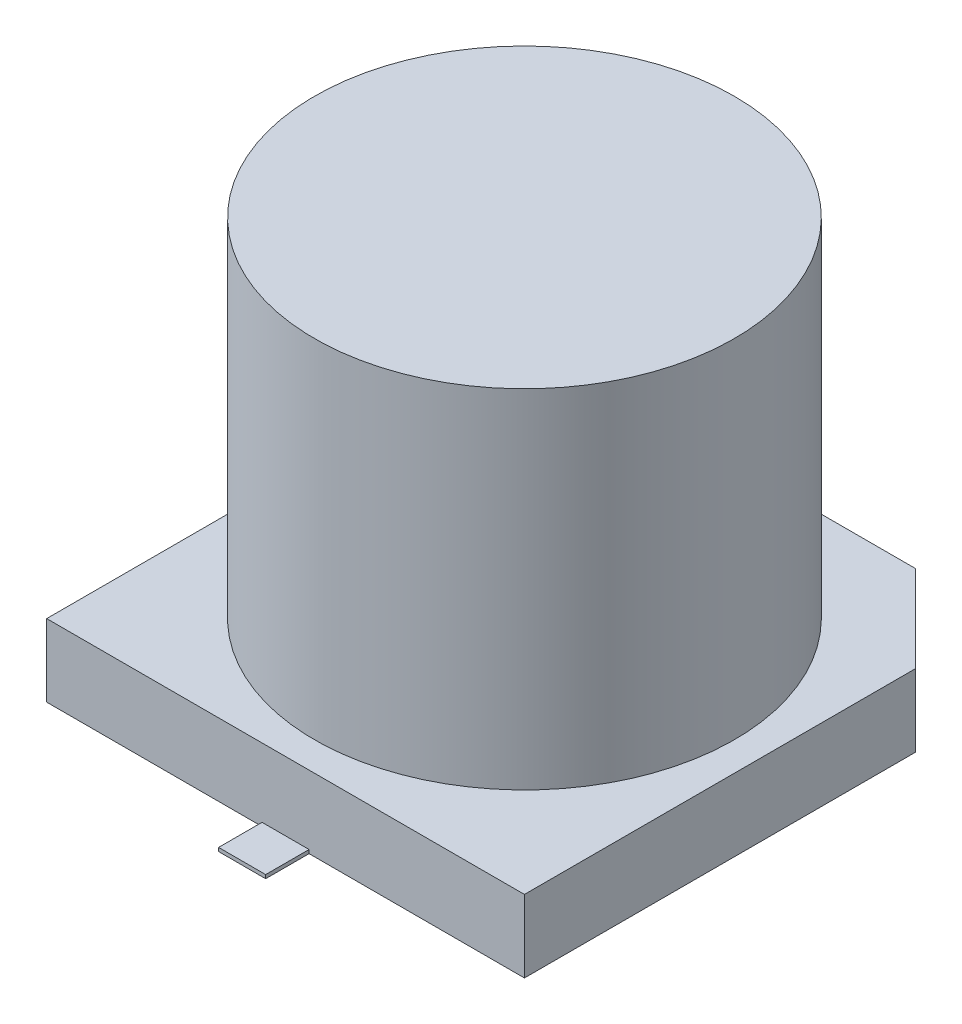
ISO-10303-21;
HEADER;
FILE_DESCRIPTION(('STEP AP214'),'2;1');
FILE_NAME('part.step','',(''),(''),'','','');
FILE_SCHEMA(('AUTOMOTIVE_DESIGN { 1 0 10303 214 1 1 1 1 }'));
ENDSEC;
DATA;
#1=APPLICATION_CONTEXT('core data for automotive mechanical design processes');
#2=APPLICATION_PROTOCOL_DEFINITION('international standard','automotive_design',2000,#1);
#3=PRODUCT_CONTEXT('',#1,'mechanical');
#4=PRODUCT('Part','Part','',(#3));
#5=PRODUCT_RELATED_PRODUCT_CATEGORY('part','',(#4));
#6=PRODUCT_DEFINITION_FORMATION('','',#4);
#7=PRODUCT_DEFINITION_CONTEXT('part definition',#1,'design');
#8=PRODUCT_DEFINITION('design','',#6,#7);
#9=PRODUCT_DEFINITION_SHAPE('','',#8);
#10=(LENGTH_UNIT() NAMED_UNIT(*) SI_UNIT(.MILLI.,.METRE.));
#11=(NAMED_UNIT(*) PLANE_ANGLE_UNIT() SI_UNIT($,.RADIAN.));
#12=(NAMED_UNIT(*) SI_UNIT($,.STERADIAN.) SOLID_ANGLE_UNIT());
#13=UNCERTAINTY_MEASURE_WITH_UNIT(LENGTH_MEASURE(1.E-05),#10,'distance_accuracy_value','');
#14=(GEOMETRIC_REPRESENTATION_CONTEXT(3) GLOBAL_UNCERTAINTY_ASSIGNED_CONTEXT((#13)) GLOBAL_UNIT_ASSIGNED_CONTEXT((#10,
#11,#12)) REPRESENTATION_CONTEXT('',''));
#15=CARTESIAN_POINT('',(0.,0.,0.));
#16=DIRECTION('',(0.,0.,1.));
#17=DIRECTION('',(1.,0.,0.));
#18=AXIS2_PLACEMENT_3D('',#15,#16,#17);
#19=CARTESIAN_POINT('',(0.324999999999992,0.0500000000000014,3.9));
#20=DIRECTION('',(0.,0.,-1.));
#21=DIRECTION('',(-1.,0.,0.));
#22=AXIS2_PLACEMENT_3D('',#19,#20,#21);
#23=PLANE('',#22);
#24=DIRECTION('',(0.,1.,0.));
#25=VECTOR('',#24,1.);
#26=CARTESIAN_POINT('',(0.325000000000006,0.0500000000000014,3.9));
#27=LINE('',#26,#25);
#28=CARTESIAN_POINT('',(0.324999999999995,0.,3.89999999999999));
#29=VERTEX_POINT('',#28);
#30=CARTESIAN_POINT('',(0.324999999999999,0.0500000000000014,3.9));
#31=VERTEX_POINT('',#30);
#32=EDGE_CURVE('E114',#29,#31,#27,.T.);
#33=ORIENTED_EDGE('',*,*,#32,.T.);
#34=DIRECTION('',(1.,0.,0.));
#35=VECTOR('',#34,1.);
#36=CARTESIAN_POINT('',(0.324999999999992,0.0500000000000014,3.9));
#37=LINE('',#36,#35);
#38=CARTESIAN_POINT('',(-0.325000000000006,0.0500000000000014,3.89999999999999));
#39=VERTEX_POINT('',#38);
#40=EDGE_CURVE('E116',#31,#39,#37,.F.);
#41=ORIENTED_EDGE('',*,*,#40,.T.);
#42=DIRECTION('',(0.,1.,0.));
#43=VECTOR('',#42,1.);
#44=CARTESIAN_POINT('',(-0.325000000000006,0.0500000000000014,3.89999999999996));
#45=LINE('',#44,#43);
#46=CARTESIAN_POINT('',(-0.325000000000002,0.,3.89999999999997));
#47=VERTEX_POINT('',#46);
#48=EDGE_CURVE('E119',#39,#47,#45,.F.);
#49=ORIENTED_EDGE('',*,*,#48,.T.);
#50=DIRECTION('',(1.,0.,0.));
#51=VECTOR('',#50,1.);
#52=CARTESIAN_POINT('',(3.3,0.,3.89999999999996));
#53=LINE('',#52,#51);
#54=EDGE_CURVE('E154',#47,#29,#53,.T.);
#55=ORIENTED_EDGE('',*,*,#54,.T.);
#56=EDGE_LOOP('',(#33,#41,#49,#55));
#57=FACE_BOUND('',#56,.T.);
#58=ADVANCED_FACE('F17',(#57),#23,.F.);
#59=CARTESIAN_POINT('',(0.325000000000006,0.0500000000000014,-3.9));
#60=DIRECTION('',(0.,0.,1.));
#61=DIRECTION('',(1.,0.,0.));
#62=AXIS2_PLACEMENT_3D('',#59,#60,#61);
#63=PLANE('',#62);
#64=DIRECTION('',(0.,1.,0.));
#65=VECTOR('',#64,1.);
#66=CARTESIAN_POINT('',(-0.324999999999992,0.0500000000000014,-3.90000000000004));
#67=LINE('',#66,#65);
#68=CARTESIAN_POINT('',(-0.324999999999992,0.,-3.90000000000001));
#69=VERTEX_POINT('',#68);
#70=CARTESIAN_POINT('',(-0.324999999999992,0.0500000000000014,-3.90000000000001));
#71=VERTEX_POINT('',#70);
#72=EDGE_CURVE('E149',#69,#71,#67,.T.);
#73=ORIENTED_EDGE('',*,*,#72,.T.);
#74=DIRECTION('',(1.,0.,0.));
#75=VECTOR('',#74,1.);
#76=CARTESIAN_POINT('',(-0.324999999999992,0.0500000000000014,-3.9));
#77=LINE('',#76,#75);
#78=CARTESIAN_POINT('',(0.324999999999999,0.0500000000000014,-3.9));
#79=VERTEX_POINT('',#78);
#80=EDGE_CURVE('E141',#79,#71,#77,.F.);
#81=ORIENTED_EDGE('',*,*,#80,.F.);
#82=DIRECTION('',(0.,1.,0.));
#83=VECTOR('',#82,1.);
#84=CARTESIAN_POINT('',(0.324999999999992,0.0500000000000014,-3.9));
#85=LINE('',#84,#83);
#86=CARTESIAN_POINT('',(0.324999999999995,0.,-3.9));
#87=VERTEX_POINT('',#86);
#88=EDGE_CURVE('E144',#79,#87,#85,.F.);
#89=ORIENTED_EDGE('',*,*,#88,.T.);
#90=DIRECTION('',(1.,0.,0.));
#91=VECTOR('',#90,1.);
#92=CARTESIAN_POINT('',(3.3,0.,-3.9));
#93=LINE('',#92,#91);
#94=EDGE_CURVE('E161',#87,#69,#93,.F.);
#95=ORIENTED_EDGE('',*,*,#94,.T.);
#96=EDGE_LOOP('',(#73,#81,#89,#95));
#97=FACE_BOUND('',#96,.T.);
#98=ADVANCED_FACE('F294',(#97),#63,.F.);
#99=CARTESIAN_POINT('',(0.324999999999992,0.0500000000000014,3.9));
#100=DIRECTION('',(0.,-1.,0.));
#101=DIRECTION('',(0.,0.,-1.));
#102=AXIS2_PLACEMENT_3D('',#99,#100,#101);
#103=PLANE('',#102);
#104=DIRECTION('',(-1.,0.,0.));
#105=VECTOR('',#104,1.);
#106=CARTESIAN_POINT('',(3.30000000000008,0.0500000000000014,3.29999999999996));
#107=LINE('',#106,#105);
#108=CARTESIAN_POINT('',(0.325000000000006,0.0500000000000014,3.29999999999997));
#109=VERTEX_POINT('',#108);
#110=CARTESIAN_POINT('',(-0.325000000000002,0.0500000000000014,3.29999999999996));
#111=VERTEX_POINT('',#110);
#112=EDGE_CURVE('E128',#109,#111,#107,.T.);
#113=ORIENTED_EDGE('',*,*,#112,.T.);
#114=DIRECTION('',(0.,0.,-1.));
#115=VECTOR('',#114,1.);
#116=CARTESIAN_POINT('',(-0.325000000000006,0.0500000000000014,3.89999999999996));
#117=LINE('',#116,#115);
#118=EDGE_CURVE('E125',#111,#39,#117,.F.);
#119=ORIENTED_EDGE('',*,*,#118,.T.);
#120=ORIENTED_EDGE('',*,*,#40,.F.);
#121=DIRECTION('',(0.,0.,1.));
#122=VECTOR('',#121,1.);
#123=CARTESIAN_POINT('',(0.325000000000006,0.0500000000000014,2.05));
#124=LINE('',#123,#122);
#125=EDGE_CURVE('E139',#31,#109,#124,.F.);
#126=ORIENTED_EDGE('',*,*,#125,.T.);
#127=EDGE_LOOP('',(#113,#119,#120,#126));
#128=FACE_BOUND('',#127,.T.);
#129=ADVANCED_FACE('F126',(#128),#103,.F.);
#130=CARTESIAN_POINT('',(-0.325000000000006,0.0500000000000014,3.89999999999996));
#131=DIRECTION('',(1.,0.,0.));
#132=DIRECTION('',(0.,0.,-1.));
#133=AXIS2_PLACEMENT_3D('',#130,#131,#132);
#134=PLANE('',#133);
#135=DIRECTION('',(0.,1.,0.));
#136=VECTOR('',#135,1.);
#137=CARTESIAN_POINT('',(-0.324999999999992,10.3338095116624,3.29999999999996));
#138=LINE('',#137,#136);
#139=CARTESIAN_POINT('',(-0.324999999999999,0.,3.29999999999997));
#140=VERTEX_POINT('',#139);
#141=EDGE_CURVE('E166',#111,#140,#138,.F.);
#142=ORIENTED_EDGE('',*,*,#141,.T.);
#143=DIRECTION('',(0.,0.,1.));
#144=VECTOR('',#143,1.);
#145=CARTESIAN_POINT('',(-0.324999999999992,0.,-3.30000000000004));
#146=LINE('',#145,#144);
#147=EDGE_CURVE('E134',#140,#47,#146,.T.);
#148=ORIENTED_EDGE('',*,*,#147,.T.);
#149=ORIENTED_EDGE('',*,*,#48,.F.);
#150=ORIENTED_EDGE('',*,*,#118,.F.);
#151=EDGE_LOOP('',(#142,#148,#149,#150));
#152=FACE_BOUND('',#151,.T.);
#153=ADVANCED_FACE('F132',(#152),#134,.F.);
#154=CARTESIAN_POINT('',(0.325000000000006,0.0500000000000014,2.05));
#155=DIRECTION('',(-1.,0.,0.));
#156=DIRECTION('',(0.,0.,1.));
#157=AXIS2_PLACEMENT_3D('',#154,#155,#156);
#158=PLANE('',#157);
#159=DIRECTION('',(0.,1.,0.));
#160=VECTOR('',#159,1.);
#161=CARTESIAN_POINT('',(0.325000000000006,10.3338095116624,3.29999999999996));
#162=LINE('',#161,#160);
#163=CARTESIAN_POINT('',(0.324999999999999,0.,3.29999999999999));
#164=VERTEX_POINT('',#163);
#165=EDGE_CURVE('E173',#164,#109,#162,.T.);
#166=ORIENTED_EDGE('',*,*,#165,.T.);
#167=ORIENTED_EDGE('',*,*,#125,.F.);
#168=ORIENTED_EDGE('',*,*,#32,.F.);
#169=DIRECTION('',(0.,0.,1.));
#170=VECTOR('',#169,1.);
#171=CARTESIAN_POINT('',(0.324999999999992,0.,-3.30000000000004));
#172=LINE('',#171,#170);
#173=EDGE_CURVE('E156',#29,#164,#172,.F.);
#174=ORIENTED_EDGE('',*,*,#173,.T.);
#175=EDGE_LOOP('',(#166,#167,#168,#174));
#176=FACE_BOUND('',#175,.T.);
#177=ADVANCED_FACE('F304',(#176),#158,.F.);
#178=CARTESIAN_POINT('',(-0.324999999999992,0.0500000000000014,-3.90000000000004));
#179=DIRECTION('',(0.,1.,0.));
#180=DIRECTION('',(0.,0.,1.));
#181=AXIS2_PLACEMENT_3D('',#178,#179,#180);
#182=PLANE('',#181);
#183=ORIENTED_EDGE('',*,*,#80,.T.);
#184=DIRECTION('',(0.,0.,-1.));
#185=VECTOR('',#184,1.);
#186=CARTESIAN_POINT('',(-0.324999999999992,0.0500000000000014,-3.90000000000004));
#187=LINE('',#186,#185);
#188=CARTESIAN_POINT('',(-0.324999999999995,0.0500000000000014,-3.30000000000004));
#189=VERTEX_POINT('',#188);
#190=EDGE_CURVE('E151',#71,#189,#187,.F.);
#191=ORIENTED_EDGE('',*,*,#190,.T.);
#192=DIRECTION('',(1.,0.,0.));
#193=VECTOR('',#192,1.);
#194=CARTESIAN_POINT('',(2.1,0.0500000000000014,-3.30000000000004));
#195=LINE('',#194,#193);
#196=CARTESIAN_POINT('',(0.324999999999992,0.0500000000000014,-3.30000000000003));
#197=VERTEX_POINT('',#196);
#198=EDGE_CURVE('E184',#189,#197,#195,.T.);
#199=ORIENTED_EDGE('',*,*,#198,.T.);
#200=DIRECTION('',(0.,0.,1.));
#201=VECTOR('',#200,1.);
#202=CARTESIAN_POINT('',(0.324999999999992,0.0500000000000014,-2.05));
#203=LINE('',#202,#201);
#204=EDGE_CURVE('E146',#197,#79,#203,.F.);
#205=ORIENTED_EDGE('',*,*,#204,.T.);
#206=EDGE_LOOP('',(#183,#191,#199,#205));
#207=FACE_BOUND('',#206,.T.);
#208=ADVANCED_FACE('F288',(#207),#182,.T.);
#209=CARTESIAN_POINT('',(0.324999999999992,0.0500000000000014,-2.05));
#210=DIRECTION('',(-1.,0.,0.));
#211=DIRECTION('',(0.,0.,1.));
#212=AXIS2_PLACEMENT_3D('',#209,#210,#211);
#213=PLANE('',#212);
#214=DIRECTION('',(0.,1.,0.));
#215=VECTOR('',#214,1.);
#216=CARTESIAN_POINT('',(0.324999999999992,10.3338095116624,-3.30000000000004));
#217=LINE('',#216,#215);
#218=CARTESIAN_POINT('',(0.324999999999992,0.,-3.30000000000002));
#219=VERTEX_POINT('',#218);
#220=EDGE_CURVE('E186',#197,#219,#217,.F.);
#221=ORIENTED_EDGE('',*,*,#220,.T.);
#222=DIRECTION('',(0.,0.,1.));
#223=VECTOR('',#222,1.);
#224=CARTESIAN_POINT('',(0.324999999999992,0.,-3.30000000000004));
#225=LINE('',#224,#223);
#226=EDGE_CURVE('E158',#219,#87,#225,.F.);
#227=ORIENTED_EDGE('',*,*,#226,.T.);
#228=ORIENTED_EDGE('',*,*,#88,.F.);
#229=ORIENTED_EDGE('',*,*,#204,.F.);
#230=EDGE_LOOP('',(#221,#227,#228,#229));
#231=FACE_BOUND('',#230,.T.);
#232=ADVANCED_FACE('F285',(#231),#213,.F.);
#233=CARTESIAN_POINT('',(-0.324999999999992,0.0500000000000014,-3.90000000000004));
#234=DIRECTION('',(1.,0.,0.));
#235=DIRECTION('',(0.,0.,-1.));
#236=AXIS2_PLACEMENT_3D('',#233,#234,#235);
#237=PLANE('',#236);
#238=DIRECTION('',(0.,1.,0.));
#239=VECTOR('',#238,1.);
#240=CARTESIAN_POINT('',(-0.325000000000006,10.3338095116624,-3.30000000000004));
#241=LINE('',#240,#239);
#242=CARTESIAN_POINT('',(-0.324999999999995,0.,-3.30000000000004));
#243=VERTEX_POINT('',#242);
#244=EDGE_CURVE('E195',#243,#189,#241,.T.);
#245=ORIENTED_EDGE('',*,*,#244,.T.);
#246=ORIENTED_EDGE('',*,*,#190,.F.);
#247=ORIENTED_EDGE('',*,*,#72,.F.);
#248=DIRECTION('',(0.,0.,1.));
#249=VECTOR('',#248,1.);
#250=CARTESIAN_POINT('',(-0.324999999999992,0.,-3.30000000000004));
#251=LINE('',#250,#249);
#252=EDGE_CURVE('E163',#69,#243,#251,.T.);
#253=ORIENTED_EDGE('',*,*,#252,.T.);
#254=EDGE_LOOP('',(#245,#246,#247,#253));
#255=FACE_BOUND('',#254,.T.);
#256=ADVANCED_FACE('F292',(#255),#237,.F.);
#257=CARTESIAN_POINT('',(3.3,0.,-3.30000000000004));
#258=DIRECTION('',(0.,1.,0.));
#259=DIRECTION('',(0.,0.,1.));
#260=AXIS2_PLACEMENT_3D('',#257,#258,#259);
#261=PLANE('',#260);
#262=ORIENTED_EDGE('',*,*,#252,.F.);
#263=ORIENTED_EDGE('',*,*,#94,.F.);
#264=ORIENTED_EDGE('',*,*,#226,.F.);
#265=DIRECTION('',(1.,0.,0.));
#266=VECTOR('',#265,1.);
#267=CARTESIAN_POINT('',(2.1,0.,-3.30000000000004));
#268=LINE('',#267,#266);
#269=CARTESIAN_POINT('',(2.1,0.,-3.30000000000004));
#270=VERTEX_POINT('',#269);
#271=EDGE_CURVE('E188',#219,#270,#268,.T.);
#272=ORIENTED_EDGE('',*,*,#271,.T.);
#273=DIRECTION('',(0.707106781186546,0.,0.707106781186549));
#274=VECTOR('',#273,1.);
#275=CARTESIAN_POINT('',(2.1,0.,-3.30000000000004));
#276=LINE('',#275,#274);
#277=CARTESIAN_POINT('',(3.30000000000006,0.,-2.1));
#278=VERTEX_POINT('',#277);
#279=EDGE_CURVE('E180',#270,#278,#276,.T.);
#280=ORIENTED_EDGE('',*,*,#279,.T.);
#281=DIRECTION('',(0.,0.,1.));
#282=VECTOR('',#281,1.);
#283=CARTESIAN_POINT('',(3.30000000000008,0.,3.29999999999996));
#284=LINE('',#283,#282);
#285=CARTESIAN_POINT('',(3.30000000000008,0.,3.29999999999998));
#286=VERTEX_POINT('',#285);
#287=EDGE_CURVE('E176',#278,#286,#284,.T.);
#288=ORIENTED_EDGE('',*,*,#287,.T.);
#289=DIRECTION('',(-1.,0.,0.));
#290=VECTOR('',#289,1.);
#291=CARTESIAN_POINT('',(3.30000000000008,0.,3.29999999999996));
#292=LINE('',#291,#290);
#293=EDGE_CURVE('E170',#286,#164,#292,.T.);
#294=ORIENTED_EDGE('',*,*,#293,.T.);
#295=ORIENTED_EDGE('',*,*,#173,.F.);
#296=ORIENTED_EDGE('',*,*,#54,.F.);
#297=ORIENTED_EDGE('',*,*,#147,.F.);
#298=DIRECTION('',(-1.,0.,0.));
#299=VECTOR('',#298,1.);
#300=CARTESIAN_POINT('',(3.30000000000008,0.,3.29999999999996));
#301=LINE('',#300,#299);
#302=CARTESIAN_POINT('',(-3.3,0.,3.29999999999998));
#303=VERTEX_POINT('',#302);
#304=EDGE_CURVE('E168',#140,#303,#301,.T.);
#305=ORIENTED_EDGE('',*,*,#304,.T.);
#306=DIRECTION('',(0.,0.,-1.));
#307=VECTOR('',#306,1.);
#308=CARTESIAN_POINT('',(-3.3,0.,3.3));
#309=LINE('',#308,#307);
#310=CARTESIAN_POINT('',(-3.30000000000001,0.,-2.1));
#311=VERTEX_POINT('',#310);
#312=EDGE_CURVE('E205',#303,#311,#309,.T.);
#313=ORIENTED_EDGE('',*,*,#312,.T.);
#314=DIRECTION('',(0.707106781186549,0.,-0.707106781186546));
#315=VECTOR('',#314,1.);
#316=CARTESIAN_POINT('',(-3.30000000000001,0.,-2.1));
#317=LINE('',#316,#315);
#318=CARTESIAN_POINT('',(-2.10000000000001,0.,-3.30000000000003));
#319=VERTEX_POINT('',#318);
#320=EDGE_CURVE('E198',#311,#319,#317,.T.);
#321=ORIENTED_EDGE('',*,*,#320,.T.);
#322=DIRECTION('',(1.,0.,0.));
#323=VECTOR('',#322,1.);
#324=CARTESIAN_POINT('',(2.1,0.,-3.30000000000004));
#325=LINE('',#324,#323);
#326=EDGE_CURVE('E192',#319,#243,#325,.T.);
#327=ORIENTED_EDGE('',*,*,#326,.T.);
#328=EDGE_LOOP('',(#262,#263,#264,#272,#280,#288,#294,#295,#296,#297,#305,#313,#321,#327));
#329=FACE_BOUND('',#328,.T.);
#330=ADVANCED_FACE('F262',(#329),#261,.F.);
#331=CARTESIAN_POINT('',(3.30000000000008,10.3338095116624,3.29999999999996));
#332=DIRECTION('',(0.,0.,-1.));
#333=DIRECTION('',(-1.,0.,0.));
#334=AXIS2_PLACEMENT_3D('',#331,#332,#333);
#335=PLANE('',#334);
#336=ORIENTED_EDGE('',*,*,#293,.F.);
#337=DIRECTION('',(0.,1.,0.));
#338=VECTOR('',#337,1.);
#339=CARTESIAN_POINT('',(3.30000000000008,10.3338095116624,3.29999999999996));
#340=LINE('',#339,#338);
#341=CARTESIAN_POINT('',(3.30000000000008,1.,3.29999999999997));
#342=VERTEX_POINT('',#341);
#343=EDGE_CURVE('E178',#286,#342,#340,.T.);
#344=ORIENTED_EDGE('',*,*,#343,.T.);
#345=DIRECTION('',(1.,0.,0.));
#346=VECTOR('',#345,1.);
#347=CARTESIAN_POINT('',(0.,1.,3.3));
#348=LINE('',#347,#346);
#349=CARTESIAN_POINT('',(-3.3,1.,3.29999999999998));
#350=VERTEX_POINT('',#349);
#351=EDGE_CURVE('E208',#350,#342,#348,.T.);
#352=ORIENTED_EDGE('',*,*,#351,.F.);
#353=DIRECTION('',(0.,1.,0.));
#354=VECTOR('',#353,1.);
#355=CARTESIAN_POINT('',(-3.3,10.3338095116624,3.3));
#356=LINE('',#355,#354);
#357=EDGE_CURVE('E202',#350,#303,#356,.F.);
#358=ORIENTED_EDGE('',*,*,#357,.T.);
#359=ORIENTED_EDGE('',*,*,#304,.F.);
#360=ORIENTED_EDGE('',*,*,#141,.F.);
#361=ORIENTED_EDGE('',*,*,#112,.F.);
#362=ORIENTED_EDGE('',*,*,#165,.F.);
#363=EDGE_LOOP('',(#336,#344,#352,#358,#359,#360,#361,#362));
#364=FACE_BOUND('',#363,.T.);
#365=ADVANCED_FACE('F269',(#364),#335,.F.);
#366=CARTESIAN_POINT('',(3.30000000000008,10.3338095116624,3.29999999999996));
#367=DIRECTION('',(-1.,0.,0.));
#368=DIRECTION('',(0.,0.,1.));
#369=AXIS2_PLACEMENT_3D('',#366,#367,#368);
#370=PLANE('',#369);
#371=ORIENTED_EDGE('',*,*,#343,.F.);
#372=ORIENTED_EDGE('',*,*,#287,.F.);
#373=DIRECTION('',(0.,1.,0.));
#374=VECTOR('',#373,1.);
#375=CARTESIAN_POINT('',(3.3,10.3338095116624,-2.10000000000004));
#376=LINE('',#375,#374);
#377=CARTESIAN_POINT('',(3.30000000000006,1.,-2.10000000000002));
#378=VERTEX_POINT('',#377);
#379=EDGE_CURVE('E182',#278,#378,#376,.T.);
#380=ORIENTED_EDGE('',*,*,#379,.T.);
#381=DIRECTION('',(0.,0.,1.));
#382=VECTOR('',#381,1.);
#383=CARTESIAN_POINT('',(3.30000000000008,1.,0.));
#384=LINE('',#383,#382);
#385=EDGE_CURVE('E211',#342,#378,#384,.F.);
#386=ORIENTED_EDGE('',*,*,#385,.F.);
#387=EDGE_LOOP('',(#371,#372,#380,#386));
#388=FACE_BOUND('',#387,.T.);
#389=ADVANCED_FACE('F274',(#388),#370,.F.);
#390=CARTESIAN_POINT('',(2.1,10.3338095116624,-3.30000000000004));
#391=DIRECTION('',(-0.707106781186549,0.,0.707106781186546));
#392=DIRECTION('',(0.707106781186546,0.,0.707106781186549));
#393=AXIS2_PLACEMENT_3D('',#390,#391,#392);
#394=PLANE('',#393);
#395=ORIENTED_EDGE('',*,*,#379,.F.);
#396=ORIENTED_EDGE('',*,*,#279,.F.);
#397=DIRECTION('',(0.,1.,0.));
#398=VECTOR('',#397,1.);
#399=CARTESIAN_POINT('',(2.1,10.3338095116624,-3.30000000000004));
#400=LINE('',#399,#398);
#401=CARTESIAN_POINT('',(2.1,0.999999999999999,-3.30000000000004));
#402=VERTEX_POINT('',#401);
#403=EDGE_CURVE('E190',#270,#402,#400,.T.);
#404=ORIENTED_EDGE('',*,*,#403,.T.);
#405=DIRECTION('',(-0.707106781186545,0.,-0.70710678118655));
#406=VECTOR('',#405,1.);
#407=CARTESIAN_POINT('',(3.3,1.,-2.10000000000004));
#408=LINE('',#407,#406);
#409=EDGE_CURVE('E214',#378,#402,#408,.T.);
#410=ORIENTED_EDGE('',*,*,#409,.F.);
#411=EDGE_LOOP('',(#395,#396,#404,#410));
#412=FACE_BOUND('',#411,.T.);
#413=ADVANCED_FACE('F279',(#412),#394,.F.);
#414=CARTESIAN_POINT('',(2.1,10.3338095116624,-3.30000000000004));
#415=DIRECTION('',(0.,0.,1.));
#416=DIRECTION('',(1.,0.,0.));
#417=AXIS2_PLACEMENT_3D('',#414,#415,#416);
#418=PLANE('',#417);
#419=ORIENTED_EDGE('',*,*,#326,.F.);
#420=DIRECTION('',(0.,1.,0.));
#421=VECTOR('',#420,1.);
#422=CARTESIAN_POINT('',(-2.09999999999999,10.3338095116624,-3.30000000000001));
#423=LINE('',#422,#421);
#424=CARTESIAN_POINT('',(-2.10000000000001,1.,-3.30000000000003));
#425=VERTEX_POINT('',#424);
#426=EDGE_CURVE('E200',#319,#425,#423,.T.);
#427=ORIENTED_EDGE('',*,*,#426,.T.);
#428=DIRECTION('',(1.,0.,0.));
#429=VECTOR('',#428,1.);
#430=CARTESIAN_POINT('',(0.,1.,-3.30000000000004));
#431=LINE('',#430,#429);
#432=EDGE_CURVE('E217',#402,#425,#431,.F.);
#433=ORIENTED_EDGE('',*,*,#432,.F.);
#434=ORIENTED_EDGE('',*,*,#403,.F.);
#435=ORIENTED_EDGE('',*,*,#271,.F.);
#436=ORIENTED_EDGE('',*,*,#220,.F.);
#437=ORIENTED_EDGE('',*,*,#198,.F.);
#438=ORIENTED_EDGE('',*,*,#244,.F.);
#439=EDGE_LOOP('',(#419,#427,#433,#434,#435,#436,#437,#438));
#440=FACE_BOUND('',#439,.T.);
#441=ADVANCED_FACE('F256',(#440),#418,.F.);
#442=CARTESIAN_POINT('',(-3.30000000000001,10.3338095116624,-2.1));
#443=DIRECTION('',(0.707106781186546,0.,0.707106781186549));
#444=DIRECTION('',(0.707106781186549,0.,-0.707106781186546));
#445=AXIS2_PLACEMENT_3D('',#442,#443,#444);
#446=PLANE('',#445);
#447=ORIENTED_EDGE('',*,*,#426,.F.);
#448=ORIENTED_EDGE('',*,*,#320,.F.);
#449=DIRECTION('',(0.,1.,0.));
#450=VECTOR('',#449,1.);
#451=CARTESIAN_POINT('',(-3.3,10.3338095116624,-2.1));
#452=LINE('',#451,#450);
#453=CARTESIAN_POINT('',(-3.30000000000001,0.999999999999999,-2.1));
#454=VERTEX_POINT('',#453);
#455=EDGE_CURVE('E33',#311,#454,#452,.T.);
#456=ORIENTED_EDGE('',*,*,#455,.T.);
#457=DIRECTION('',(-0.707106781186533,0.,0.707106781186562));
#458=VECTOR('',#457,1.);
#459=CARTESIAN_POINT('',(-2.10000000000002,1.,-3.30000000000004));
#460=LINE('',#459,#458);
#461=EDGE_CURVE('E220',#425,#454,#460,.T.);
#462=ORIENTED_EDGE('',*,*,#461,.F.);
#463=EDGE_LOOP('',(#447,#448,#456,#462));
#464=FACE_BOUND('',#463,.T.);
#465=ADVANCED_FACE('F243',(#464),#446,.F.);
#466=CARTESIAN_POINT('',(-3.3,10.3338095116624,3.3));
#467=DIRECTION('',(1.,0.,0.));
#468=DIRECTION('',(0.,0.,-1.));
#469=AXIS2_PLACEMENT_3D('',#466,#467,#468);
#470=PLANE('',#469);
#471=ORIENTED_EDGE('',*,*,#455,.F.);
#472=ORIENTED_EDGE('',*,*,#312,.F.);
#473=ORIENTED_EDGE('',*,*,#357,.F.);
#474=DIRECTION('',(0.,0.,1.));
#475=VECTOR('',#474,1.);
#476=CARTESIAN_POINT('',(-3.30000000000001,1.,0.));
#477=LINE('',#476,#475);
#478=EDGE_CURVE('E223',#454,#350,#477,.T.);
#479=ORIENTED_EDGE('',*,*,#478,.F.);
#480=EDGE_LOOP('',(#471,#472,#473,#479));
#481=FACE_BOUND('',#480,.T.);
#482=ADVANCED_FACE('F234',(#481),#470,.F.);
#483=CARTESIAN_POINT('',(0.,5.8,0.));
#484=DIRECTION('',(0.,1.,0.));
#485=DIRECTION('',(0.,0.,1.));
#486=AXIS2_PLACEMENT_3D('',#483,#484,#485);
#487=PLANE('',#486);
#488=CARTESIAN_POINT('',(0.,5.8,0.));
#489=DIRECTION('',(0.,-1.,0.));
#490=DIRECTION('',(0.,0.,-1.));
#491=AXIS2_PLACEMENT_3D('',#488,#489,#490);
#492=CIRCLE('',#491,2.90000000000001);
#493=CARTESIAN_POINT('',(0.,5.8,-2.90000000000001));
#494=VERTEX_POINT('',#493);
#495=EDGE_CURVE('E20',#494,#494,#492,.T.);
#496=ORIENTED_EDGE('',*,*,#495,.F.);
#497=EDGE_LOOP('',(#496));
#498=FACE_BOUND('',#497,.T.);
#499=ADVANCED_FACE('F231',(#498),#487,.T.);
#500=CARTESIAN_POINT('',(0.,1.,0.));
#501=DIRECTION('',(0.,1.,0.));
#502=DIRECTION('',(0.,0.,1.));
#503=AXIS2_PLACEMENT_3D('',#500,#501,#502);
#504=PLANE('',#503);
#505=CARTESIAN_POINT('',(0.,1.,0.));
#506=DIRECTION('',(0.,-1.,0.));
#507=DIRECTION('',(0.,0.,-1.));
#508=AXIS2_PLACEMENT_3D('',#505,#506,#507);
#509=CIRCLE('',#508,2.90000000000001);
#510=CARTESIAN_POINT('',(0.,1.,-2.90000000000001));
#511=VERTEX_POINT('',#510);
#512=EDGE_CURVE('E11',#511,#511,#509,.F.);
#513=ORIENTED_EDGE('',*,*,#512,.F.);
#514=EDGE_LOOP('',(#513));
#515=FACE_BOUND('',#514,.T.);
#516=ORIENTED_EDGE('',*,*,#461,.T.);
#517=ORIENTED_EDGE('',*,*,#478,.T.);
#518=ORIENTED_EDGE('',*,*,#351,.T.);
#519=ORIENTED_EDGE('',*,*,#385,.T.);
#520=ORIENTED_EDGE('',*,*,#409,.T.);
#521=ORIENTED_EDGE('',*,*,#432,.T.);
#522=EDGE_LOOP('',(#516,#517,#518,#519,#520,#521));
#523=FACE_BOUND('',#522,.T.);
#524=ADVANCED_FACE('F233',(#515,#523),#504,.T.);
#525=CARTESIAN_POINT('',(0.,5.8,0.));
#526=DIRECTION('',(0.,-1.,0.));
#527=DIRECTION('',(0.,0.,-1.));
#528=AXIS2_PLACEMENT_3D('',#525,#526,#527);
#529=CYLINDRICAL_SURFACE('',#528,2.90000000000001);
#530=ORIENTED_EDGE('',*,*,#512,.T.);
#531=EDGE_LOOP('',(#530));
#532=FACE_BOUND('',#531,.T.);
#533=ORIENTED_EDGE('',*,*,#495,.T.);
#534=EDGE_LOOP('',(#533));
#535=FACE_BOUND('',#534,.T.);
#536=ADVANCED_FACE('F229',(#532,#535),#529,.T.);
#537=CLOSED_SHELL('',(#58,#98,#129,#153,#177,#208,#232,#256,#330,#365,#389,#413,#441,#465,#482,
#499,#524,#536));
#538=MANIFOLD_SOLID_BREP('B1',#537);
#539=ADVANCED_BREP_SHAPE_REPRESENTATION('',(#18,#538),#14);
#540=SHAPE_DEFINITION_REPRESENTATION(#9,#539);
ENDSEC;
END-ISO-10303-21;
